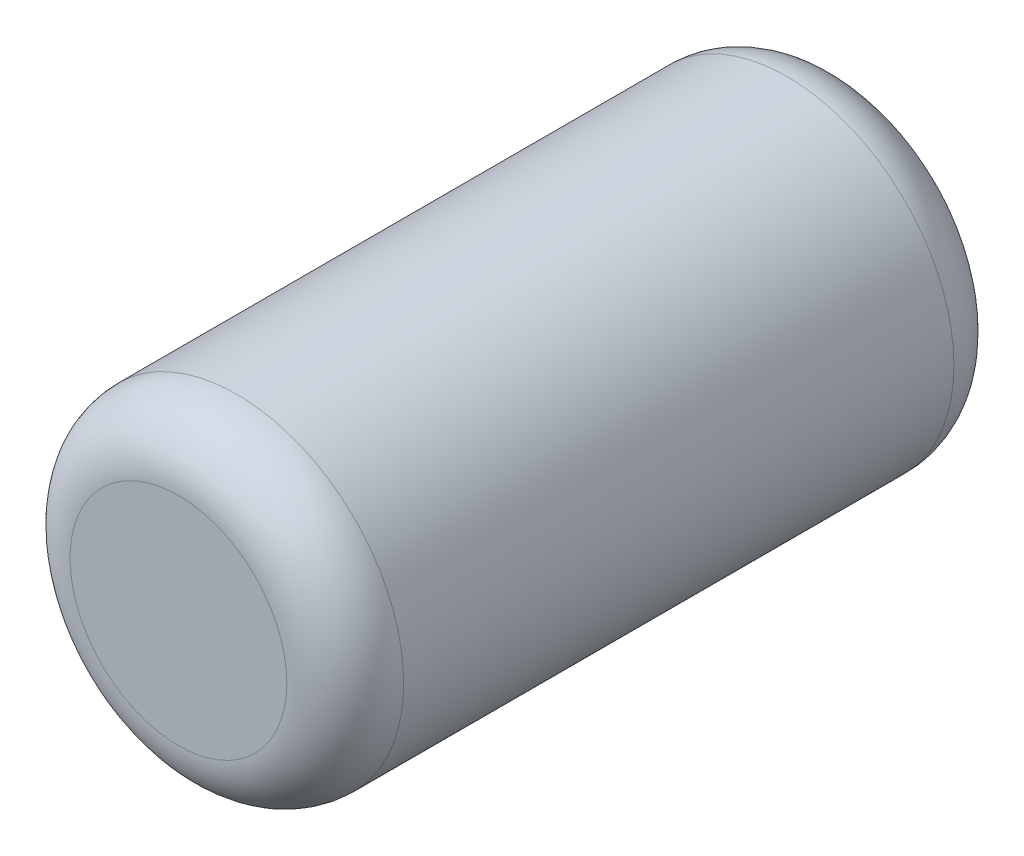
ISO-10303-21;
HEADER;
FILE_DESCRIPTION(('STEP AP214'),'2;1');
FILE_NAME('part.step','',(''),(''),'','','');
FILE_SCHEMA(('AUTOMOTIVE_DESIGN { 1 0 10303 214 1 1 1 1 }'));
ENDSEC;
DATA;
#1=APPLICATION_CONTEXT('core data for automotive mechanical design processes');
#2=APPLICATION_PROTOCOL_DEFINITION('international standard','automotive_design',2000,#1);
#3=PRODUCT_CONTEXT('',#1,'mechanical');
#4=PRODUCT('Part','Part','',(#3));
#5=PRODUCT_RELATED_PRODUCT_CATEGORY('part','',(#4));
#6=PRODUCT_DEFINITION_FORMATION('','',#4);
#7=PRODUCT_DEFINITION_CONTEXT('part definition',#1,'design');
#8=PRODUCT_DEFINITION('design','',#6,#7);
#9=PRODUCT_DEFINITION_SHAPE('','',#8);
#10=(LENGTH_UNIT() NAMED_UNIT(*) SI_UNIT(.MILLI.,.METRE.));
#11=(NAMED_UNIT(*) PLANE_ANGLE_UNIT() SI_UNIT($,.RADIAN.));
#12=(NAMED_UNIT(*) SI_UNIT($,.STERADIAN.) SOLID_ANGLE_UNIT());
#13=UNCERTAINTY_MEASURE_WITH_UNIT(LENGTH_MEASURE(1.E-05),#10,'distance_accuracy_value','');
#14=(GEOMETRIC_REPRESENTATION_CONTEXT(3) GLOBAL_UNCERTAINTY_ASSIGNED_CONTEXT((#13)) GLOBAL_UNIT_ASSIGNED_CONTEXT((#10,
#11,#12)) REPRESENTATION_CONTEXT('',''));
#15=CARTESIAN_POINT('',(0.,0.,0.));
#16=DIRECTION('',(0.,0.,1.));
#17=DIRECTION('',(1.,0.,0.));
#18=AXIS2_PLACEMENT_3D('',#15,#16,#17);
#19=CARTESIAN_POINT('',(0.,0.,2.));
#20=DIRECTION('',(0.,0.,-1.));
#21=DIRECTION('',(-1.,0.,0.));
#22=AXIS2_PLACEMENT_3D('',#19,#20,#21);
#23=CYLINDRICAL_SURFACE('',#22,1.);
#24=CARTESIAN_POINT('',(0.,0.,-1.65));
#25=DIRECTION('',(0.,0.,1.));
#26=DIRECTION('',(1.,0.,0.));
#27=AXIS2_PLACEMENT_3D('',#24,#25,#26);
#28=CIRCLE('',#27,1.);
#29=CARTESIAN_POINT('',(1.,0.,-1.65));
#30=VERTEX_POINT('',#29);
#31=EDGE_CURVE('E42',#30,#30,#28,.T.);
#32=ORIENTED_EDGE('',*,*,#31,.T.);
#33=EDGE_LOOP('',(#32));
#34=FACE_BOUND('',#33,.T.);
#35=CARTESIAN_POINT('',(0.,0.,1.65));
#36=DIRECTION('',(0.,0.,1.));
#37=DIRECTION('',(1.,0.,0.));
#38=AXIS2_PLACEMENT_3D('',#35,#36,#37);
#39=CIRCLE('',#38,1.);
#40=CARTESIAN_POINT('',(1.,0.,1.65));
#41=VERTEX_POINT('',#40);
#42=EDGE_CURVE('E46',#41,#41,#39,.F.);
#43=ORIENTED_EDGE('',*,*,#42,.T.);
#44=EDGE_LOOP('',(#43));
#45=FACE_BOUND('',#44,.T.);
#46=ADVANCED_FACE('F31',(#34,#45),#23,.T.);
#47=CARTESIAN_POINT('',(0.,0.,2.));
#48=DIRECTION('',(0.,0.,1.));
#49=DIRECTION('',(1.,0.,0.));
#50=AXIS2_PLACEMENT_3D('',#47,#48,#49);
#51=PLANE('',#50);
#52=CARTESIAN_POINT('',(0.,0.,2.));
#53=DIRECTION('',(0.,0.,1.));
#54=DIRECTION('',(1.,0.,0.));
#55=AXIS2_PLACEMENT_3D('',#52,#53,#54);
#56=CIRCLE('',#55,0.65);
#57=CARTESIAN_POINT('',(0.65,0.,2.));
#58=VERTEX_POINT('',#57);
#59=EDGE_CURVE('E10',#58,#58,#56,.T.);
#60=ORIENTED_EDGE('',*,*,#59,.T.);
#61=EDGE_LOOP('',(#60));
#62=FACE_BOUND('',#61,.T.);
#63=ADVANCED_FACE('F62',(#62),#51,.T.);
#64=CARTESIAN_POINT('',(0.,0.,-2.));
#65=DIRECTION('',(0.,0.,1.));
#66=DIRECTION('',(1.,0.,0.));
#67=AXIS2_PLACEMENT_3D('',#64,#65,#66);
#68=PLANE('',#67);
#69=CARTESIAN_POINT('',(0.,0.,-2.));
#70=DIRECTION('',(0.,0.,1.));
#71=DIRECTION('',(1.,0.,0.));
#72=AXIS2_PLACEMENT_3D('',#69,#70,#71);
#73=CIRCLE('',#72,0.65);
#74=CARTESIAN_POINT('',(0.65,0.,-2.));
#75=VERTEX_POINT('',#74);
#76=EDGE_CURVE('E38',#75,#75,#73,.F.);
#77=ORIENTED_EDGE('',*,*,#76,.T.);
#78=EDGE_LOOP('',(#77));
#79=FACE_BOUND('',#78,.T.);
#80=ADVANCED_FACE('F59',(#79),#68,.F.);
#81=CARTESIAN_POINT('',(0.,0.,-1.65));
#82=DIRECTION('',(0.,0.,1.));
#83=DIRECTION('',(1.,0.,0.));
#84=AXIS2_PLACEMENT_3D('',#81,#82,#83);
#85=TOROIDAL_SURFACE('',#84,0.65,0.35);
#86=ORIENTED_EDGE('',*,*,#76,.F.);
#87=EDGE_LOOP('',(#86));
#88=FACE_BOUND('',#87,.T.);
#89=ORIENTED_EDGE('',*,*,#31,.F.);
#90=EDGE_LOOP('',(#89));
#91=FACE_BOUND('',#90,.T.);
#92=ADVANCED_FACE('F55',(#88,#91),#85,.T.);
#93=CARTESIAN_POINT('',(0.,0.,1.65));
#94=DIRECTION('',(0.,0.,1.));
#95=DIRECTION('',(1.,0.,0.));
#96=AXIS2_PLACEMENT_3D('',#93,#94,#95);
#97=TOROIDAL_SURFACE('',#96,0.65,0.35);
#98=ORIENTED_EDGE('',*,*,#42,.F.);
#99=EDGE_LOOP('',(#98));
#100=FACE_BOUND('',#99,.T.);
#101=ORIENTED_EDGE('',*,*,#59,.F.);
#102=EDGE_LOOP('',(#101));
#103=FACE_BOUND('',#102,.T.);
#104=ADVANCED_FACE('F33',(#100,#103),#97,.T.);
#105=CLOSED_SHELL('',(#46,#63,#80,#92,#104));
#106=MANIFOLD_SOLID_BREP('B2',#105);
#107=ADVANCED_BREP_SHAPE_REPRESENTATION('',(#18,#106),#14);
#108=SHAPE_DEFINITION_REPRESENTATION(#9,#107);
ENDSEC;
END-ISO-10303-21;
